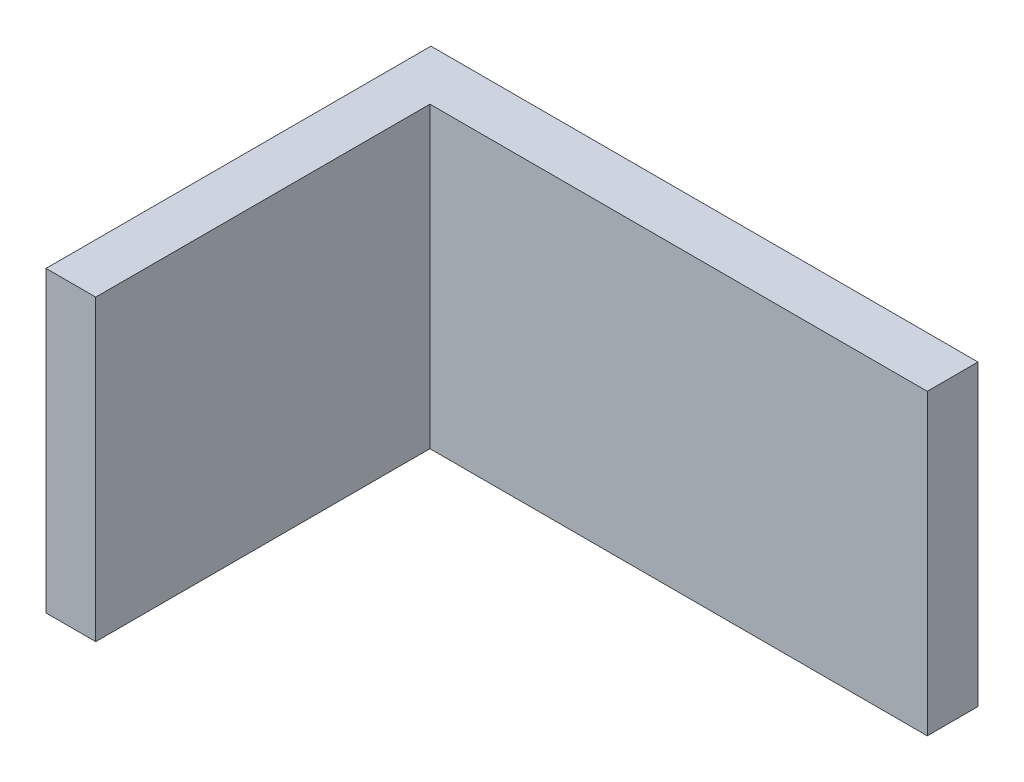
ISO-10303-21;
HEADER;
FILE_DESCRIPTION(('STEP AP214'),'2;1');
FILE_NAME('part.step','',(''),(''),'','','');
FILE_SCHEMA(('AUTOMOTIVE_DESIGN { 1 0 10303 214 1 1 1 1 }'));
ENDSEC;
DATA;
#1=APPLICATION_CONTEXT('core data for automotive mechanical design processes');
#2=APPLICATION_PROTOCOL_DEFINITION('international standard','automotive_design',2000,#1);
#3=PRODUCT_CONTEXT('',#1,'mechanical');
#4=PRODUCT('Part','Part','',(#3));
#5=PRODUCT_RELATED_PRODUCT_CATEGORY('part','',(#4));
#6=PRODUCT_DEFINITION_FORMATION('','',#4);
#7=PRODUCT_DEFINITION_CONTEXT('part definition',#1,'design');
#8=PRODUCT_DEFINITION('design','',#6,#7);
#9=PRODUCT_DEFINITION_SHAPE('','',#8);
#10=(LENGTH_UNIT() NAMED_UNIT(*) SI_UNIT(.MILLI.,.METRE.));
#11=(NAMED_UNIT(*) PLANE_ANGLE_UNIT() SI_UNIT($,.RADIAN.));
#12=(NAMED_UNIT(*) SI_UNIT($,.STERADIAN.) SOLID_ANGLE_UNIT());
#13=UNCERTAINTY_MEASURE_WITH_UNIT(LENGTH_MEASURE(1.E-05),#10,'distance_accuracy_value','');
#14=(GEOMETRIC_REPRESENTATION_CONTEXT(3) GLOBAL_UNCERTAINTY_ASSIGNED_CONTEXT((#13)) GLOBAL_UNIT_ASSIGNED_CONTEXT((#10,
#11,#12)) REPRESENTATION_CONTEXT('',''));
#15=CARTESIAN_POINT('',(0.,0.,0.));
#16=DIRECTION('',(0.,0.,1.));
#17=DIRECTION('',(1.,0.,0.));
#18=AXIS2_PLACEMENT_3D('',#15,#16,#17);
#19=CARTESIAN_POINT('',(-4.55,-2.4,0.));
#20=DIRECTION('',(0.,-1.,0.));
#21=DIRECTION('',(0.,0.,1.));
#22=AXIS2_PLACEMENT_3D('',#19,#20,#21);
#23=PLANE('',#22);
#24=DIRECTION('',(-1.,0.,0.));
#25=VECTOR('',#24,1.);
#26=CARTESIAN_POINT('',(-4.,-2.4,0.));
#27=LINE('',#26,#25);
#28=CARTESIAN_POINT('',(-4.,-2.4,0.));
#29=VERTEX_POINT('',#28);
#30=CARTESIAN_POINT('',(-4.55,-2.4,0.));
#31=VERTEX_POINT('',#30);
#32=EDGE_CURVE('E11',#29,#31,#27,.T.);
#33=ORIENTED_EDGE('',*,*,#32,.F.);
#34=DIRECTION('',(0.,0.,-1.));
#35=VECTOR('',#34,1.);
#36=CARTESIAN_POINT('',(-4.,-2.4,0.051));
#37=LINE('',#36,#35);
#38=CARTESIAN_POINT('',(-4.,-2.4,0.051));
#39=VERTEX_POINT('',#38);
#40=EDGE_CURVE('E24',#39,#29,#37,.T.);
#41=ORIENTED_EDGE('',*,*,#40,.F.);
#42=DIRECTION('',(1.,0.,0.));
#43=VECTOR('',#42,1.);
#44=CARTESIAN_POINT('',(-4.5,-2.4,0.051));
#45=LINE('',#44,#43);
#46=CARTESIAN_POINT('',(-4.5,-2.4,0.051));
#47=VERTEX_POINT('',#46);
#48=EDGE_CURVE('E87',#47,#39,#45,.T.);
#49=ORIENTED_EDGE('',*,*,#48,.F.);
#50=DIRECTION('',(0.,0.,-1.));
#51=VECTOR('',#50,1.);
#52=CARTESIAN_POINT('',(-4.5,-2.4,0.387));
#53=LINE('',#52,#51);
#54=CARTESIAN_POINT('',(-4.5,-2.4,0.387));
#55=VERTEX_POINT('',#54);
#56=EDGE_CURVE('E114',#55,#47,#53,.T.);
#57=ORIENTED_EDGE('',*,*,#56,.F.);
#58=DIRECTION('',(1.,0.,0.));
#59=VECTOR('',#58,1.);
#60=CARTESIAN_POINT('',(-4.55,-2.4,0.387));
#61=LINE('',#60,#59);
#62=CARTESIAN_POINT('',(-4.55,-2.4,0.387));
#63=VERTEX_POINT('',#62);
#64=EDGE_CURVE('E111',#63,#55,#61,.T.);
#65=ORIENTED_EDGE('',*,*,#64,.F.);
#66=DIRECTION('',(0.,0.,1.));
#67=VECTOR('',#66,1.);
#68=CARTESIAN_POINT('',(-4.55,-2.4,0.));
#69=LINE('',#68,#67);
#70=EDGE_CURVE('E108',#31,#63,#69,.T.);
#71=ORIENTED_EDGE('',*,*,#70,.F.);
#72=EDGE_LOOP('',(#33,#41,#49,#57,#65,#71));
#73=FACE_BOUND('',#72,.T.);
#74=ADVANCED_FACE('F17',(#73),#23,.T.);
#75=CARTESIAN_POINT('',(-4.,-2.1,0.));
#76=DIRECTION('',(0.,1.,0.));
#77=DIRECTION('',(0.,0.,1.));
#78=AXIS2_PLACEMENT_3D('',#75,#76,#77);
#79=PLANE('',#78);
#80=DIRECTION('',(1.,0.,0.));
#81=VECTOR('',#80,1.);
#82=CARTESIAN_POINT('',(-4.55,-2.1,0.));
#83=LINE('',#82,#81);
#84=CARTESIAN_POINT('',(-4.55,-2.1,0.));
#85=VERTEX_POINT('',#84);
#86=CARTESIAN_POINT('',(-4.,-2.1,0.));
#87=VERTEX_POINT('',#86);
#88=EDGE_CURVE('E106',#85,#87,#83,.T.);
#89=ORIENTED_EDGE('',*,*,#88,.F.);
#90=DIRECTION('',(0.,0.,-1.));
#91=VECTOR('',#90,1.);
#92=CARTESIAN_POINT('',(-4.55,-2.1,0.387));
#93=LINE('',#92,#91);
#94=CARTESIAN_POINT('',(-4.55,-2.1,0.387));
#95=VERTEX_POINT('',#94);
#96=EDGE_CURVE('E103',#95,#85,#93,.T.);
#97=ORIENTED_EDGE('',*,*,#96,.F.);
#98=DIRECTION('',(-1.,0.,0.));
#99=VECTOR('',#98,1.);
#100=CARTESIAN_POINT('',(-4.5,-2.1,0.387));
#101=LINE('',#100,#99);
#102=CARTESIAN_POINT('',(-4.5,-2.1,0.387));
#103=VERTEX_POINT('',#102);
#104=EDGE_CURVE('E100',#103,#95,#101,.T.);
#105=ORIENTED_EDGE('',*,*,#104,.F.);
#106=DIRECTION('',(0.,0.,1.));
#107=VECTOR('',#106,1.);
#108=CARTESIAN_POINT('',(-4.5,-2.1,0.051));
#109=LINE('',#108,#107);
#110=CARTESIAN_POINT('',(-4.5,-2.1,0.051));
#111=VERTEX_POINT('',#110);
#112=EDGE_CURVE('E72',#111,#103,#109,.T.);
#113=ORIENTED_EDGE('',*,*,#112,.F.);
#114=DIRECTION('',(-1.,0.,0.));
#115=VECTOR('',#114,1.);
#116=CARTESIAN_POINT('',(-4.,-2.1,0.051));
#117=LINE('',#116,#115);
#118=CARTESIAN_POINT('',(-4.,-2.1,0.051));
#119=VERTEX_POINT('',#118);
#120=EDGE_CURVE('E66',#119,#111,#117,.T.);
#121=ORIENTED_EDGE('',*,*,#120,.F.);
#122=DIRECTION('',(0.,0.,1.));
#123=VECTOR('',#122,1.);
#124=CARTESIAN_POINT('',(-4.,-2.1,0.));
#125=LINE('',#124,#123);
#126=EDGE_CURVE('E69',#87,#119,#125,.T.);
#127=ORIENTED_EDGE('',*,*,#126,.F.);
#128=EDGE_LOOP('',(#89,#97,#105,#113,#121,#127));
#129=FACE_BOUND('',#128,.T.);
#130=ADVANCED_FACE('F68',(#129),#79,.T.);
#131=CARTESIAN_POINT('',(-4.55,-2.4,0.387));
#132=DIRECTION('',(0.,0.,1.));
#133=DIRECTION('',(0.,1.,0.));
#134=AXIS2_PLACEMENT_3D('',#131,#132,#133);
#135=PLANE('',#134);
#136=ORIENTED_EDGE('',*,*,#64,.T.);
#137=DIRECTION('',(0.,-1.,0.));
#138=VECTOR('',#137,1.);
#139=CARTESIAN_POINT('',(-4.5,-2.1,0.387));
#140=LINE('',#139,#138);
#141=EDGE_CURVE('E83',#103,#55,#140,.T.);
#142=ORIENTED_EDGE('',*,*,#141,.F.);
#143=ORIENTED_EDGE('',*,*,#104,.T.);
#144=DIRECTION('',(0.,1.,0.));
#145=VECTOR('',#144,1.);
#146=CARTESIAN_POINT('',(-4.55,-2.4,0.387));
#147=LINE('',#146,#145);
#148=EDGE_CURVE('E88',#63,#95,#147,.T.);
#149=ORIENTED_EDGE('',*,*,#148,.F.);
#150=EDGE_LOOP('',(#136,#142,#143,#149));
#151=FACE_BOUND('',#150,.T.);
#152=ADVANCED_FACE('F125',(#151),#135,.T.);
#153=CARTESIAN_POINT('',(-4.5,-2.4,0.051));
#154=DIRECTION('',(0.,0.,1.));
#155=DIRECTION('',(0.,1.,0.));
#156=AXIS2_PLACEMENT_3D('',#153,#154,#155);
#157=PLANE('',#156);
#158=ORIENTED_EDGE('',*,*,#48,.T.);
#159=DIRECTION('',(0.,-1.,0.));
#160=VECTOR('',#159,1.);
#161=CARTESIAN_POINT('',(-4.,-2.1,0.051));
#162=LINE('',#161,#160);
#163=EDGE_CURVE('E81',#119,#39,#162,.T.);
#164=ORIENTED_EDGE('',*,*,#163,.F.);
#165=ORIENTED_EDGE('',*,*,#120,.T.);
#166=DIRECTION('',(0.,1.,0.));
#167=VECTOR('',#166,1.);
#168=CARTESIAN_POINT('',(-4.5,-2.4,0.051));
#169=LINE('',#168,#167);
#170=EDGE_CURVE('E89',#47,#111,#169,.T.);
#171=ORIENTED_EDGE('',*,*,#170,.F.);
#172=EDGE_LOOP('',(#158,#164,#165,#171));
#173=FACE_BOUND('',#172,.T.);
#174=ADVANCED_FACE('F86',(#173),#157,.T.);
#175=CARTESIAN_POINT('',(-4.55,-2.1,0.));
#176=DIRECTION('',(-1.,0.,0.));
#177=DIRECTION('',(0.,0.,1.));
#178=AXIS2_PLACEMENT_3D('',#175,#176,#177);
#179=PLANE('',#178);
#180=DIRECTION('',(0.,1.,0.));
#181=VECTOR('',#180,1.);
#182=CARTESIAN_POINT('',(-4.55,-2.4,0.));
#183=LINE('',#182,#181);
#184=EDGE_CURVE('E93',#31,#85,#183,.T.);
#185=ORIENTED_EDGE('',*,*,#184,.F.);
#186=ORIENTED_EDGE('',*,*,#70,.T.);
#187=ORIENTED_EDGE('',*,*,#148,.T.);
#188=ORIENTED_EDGE('',*,*,#96,.T.);
#189=EDGE_LOOP('',(#185,#186,#187,#188));
#190=FACE_BOUND('',#189,.T.);
#191=ADVANCED_FACE('F121',(#190),#179,.T.);
#192=CARTESIAN_POINT('',(-4.,-2.4,0.));
#193=DIRECTION('',(1.,0.,0.));
#194=DIRECTION('',(0.,0.,1.));
#195=AXIS2_PLACEMENT_3D('',#192,#193,#194);
#196=PLANE('',#195);
#197=DIRECTION('',(0.,-1.,0.));
#198=VECTOR('',#197,1.);
#199=CARTESIAN_POINT('',(-4.,-2.1,0.));
#200=LINE('',#199,#198);
#201=EDGE_CURVE('E82',#87,#29,#200,.T.);
#202=ORIENTED_EDGE('',*,*,#201,.F.);
#203=ORIENTED_EDGE('',*,*,#126,.T.);
#204=ORIENTED_EDGE('',*,*,#163,.T.);
#205=ORIENTED_EDGE('',*,*,#40,.T.);
#206=EDGE_LOOP('',(#202,#203,#204,#205));
#207=FACE_BOUND('',#206,.T.);
#208=ADVANCED_FACE('F80',(#207),#196,.T.);
#209=CARTESIAN_POINT('',(-4.5,-2.4,0.051));
#210=DIRECTION('',(1.,0.,0.));
#211=DIRECTION('',(0.,0.,1.));
#212=AXIS2_PLACEMENT_3D('',#209,#210,#211);
#213=PLANE('',#212);
#214=ORIENTED_EDGE('',*,*,#170,.T.);
#215=ORIENTED_EDGE('',*,*,#112,.T.);
#216=ORIENTED_EDGE('',*,*,#141,.T.);
#217=ORIENTED_EDGE('',*,*,#56,.T.);
#218=EDGE_LOOP('',(#214,#215,#216,#217));
#219=FACE_BOUND('',#218,.T.);
#220=ADVANCED_FACE('F127',(#219),#213,.T.);
#221=CARTESIAN_POINT('',(-4.55,-2.1,0.));
#222=DIRECTION('',(0.,0.,-1.));
#223=DIRECTION('',(0.,1.,0.));
#224=AXIS2_PLACEMENT_3D('',#221,#222,#223);
#225=PLANE('',#224);
#226=ORIENTED_EDGE('',*,*,#88,.T.);
#227=ORIENTED_EDGE('',*,*,#201,.T.);
#228=ORIENTED_EDGE('',*,*,#32,.T.);
#229=ORIENTED_EDGE('',*,*,#184,.T.);
#230=EDGE_LOOP('',(#226,#227,#228,#229));
#231=FACE_BOUND('',#230,.T.);
#232=ADVANCED_FACE('F117',(#231),#225,.T.);
#233=CLOSED_SHELL('',(#74,#130,#152,#174,#191,#208,#220,#232));
#234=MANIFOLD_SOLID_BREP('B1',#233);
#235=ADVANCED_BREP_SHAPE_REPRESENTATION('',(#18,#234),#14);
#236=SHAPE_DEFINITION_REPRESENTATION(#9,#235);
ENDSEC;
END-ISO-10303-21;
